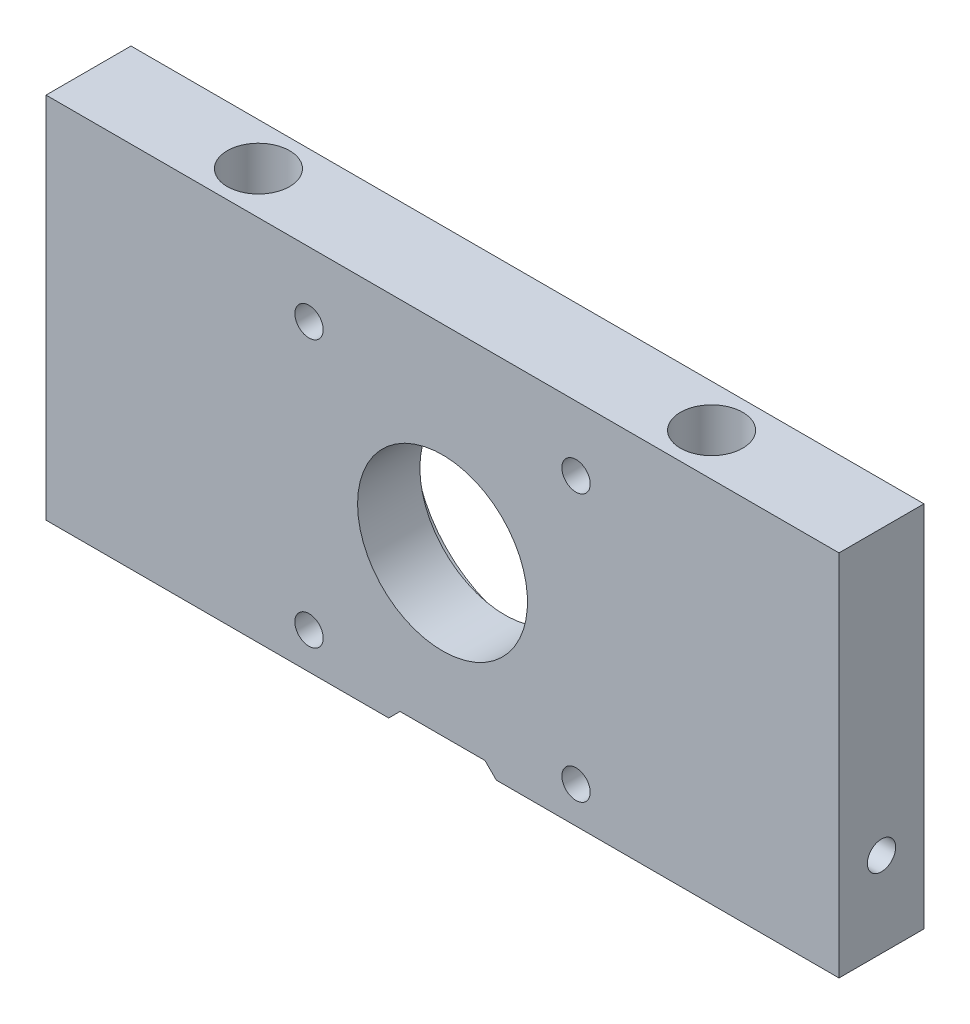
ISO-10303-21;
HEADER;
FILE_DESCRIPTION(('STEP AP214'),'2;1');
FILE_NAME('part.step','',(''),(''),'','','');
FILE_SCHEMA(('AUTOMOTIVE_DESIGN { 1 0 10303 214 1 1 1 1 }'));
ENDSEC;
DATA;
#1=APPLICATION_CONTEXT('core data for automotive mechanical design processes');
#2=APPLICATION_PROTOCOL_DEFINITION('international standard','automotive_design',2000,#1);
#3=PRODUCT_CONTEXT('',#1,'mechanical');
#4=PRODUCT('Part','Part','',(#3));
#5=PRODUCT_RELATED_PRODUCT_CATEGORY('part','',(#4));
#6=PRODUCT_DEFINITION_FORMATION('','',#4);
#7=PRODUCT_DEFINITION_CONTEXT('part definition',#1,'design');
#8=PRODUCT_DEFINITION('design','',#6,#7);
#9=PRODUCT_DEFINITION_SHAPE('','',#8);
#10=(LENGTH_UNIT() NAMED_UNIT(*) SI_UNIT(.MILLI.,.METRE.));
#11=(NAMED_UNIT(*) PLANE_ANGLE_UNIT() SI_UNIT($,.RADIAN.));
#12=(NAMED_UNIT(*) SI_UNIT($,.STERADIAN.) SOLID_ANGLE_UNIT());
#13=UNCERTAINTY_MEASURE_WITH_UNIT(LENGTH_MEASURE(1.E-05),#10,'distance_accuracy_value','');
#14=(GEOMETRIC_REPRESENTATION_CONTEXT(3) GLOBAL_UNCERTAINTY_ASSIGNED_CONTEXT((#13)) GLOBAL_UNIT_ASSIGNED_CONTEXT((#10,
#11,#12)) REPRESENTATION_CONTEXT('',''));
#15=CARTESIAN_POINT('',(0.,0.,0.));
#16=DIRECTION('',(0.,0.,1.));
#17=DIRECTION('',(1.,0.,0.));
#18=AXIS2_PLACEMENT_3D('',#15,#16,#17);
#19=CARTESIAN_POINT('',(0.,-2.49999999999999,-12.));
#20=DIRECTION('',(0.,0.,1.));
#21=DIRECTION('',(1.,0.,0.));
#22=AXIS2_PLACEMENT_3D('',#19,#20,#21);
#23=CYLINDRICAL_SURFACE('',#22,15.);
#24=CARTESIAN_POINT('',(0.,-2.49999999999999,15.));
#25=DIRECTION('',(0.,0.,-1.));
#26=DIRECTION('',(-1.,0.,0.));
#27=AXIS2_PLACEMENT_3D('',#24,#25,#26);
#28=CIRCLE('',#27,15.);
#29=CARTESIAN_POINT('',(-15.,-2.49999999999999,15.));
#30=VERTEX_POINT('',#29);
#31=EDGE_CURVE('E135',#30,#30,#28,.T.);
#32=ORIENTED_EDGE('',*,*,#31,.F.);
#33=EDGE_LOOP('',(#32));
#34=FACE_BOUND('',#33,.T.);
#35=CARTESIAN_POINT('',(0.,-2.49999999999999,4.));
#36=DIRECTION('',(0.,0.,-1.));
#37=DIRECTION('',(-1.,0.,0.));
#38=AXIS2_PLACEMENT_3D('',#35,#36,#37);
#39=CIRCLE('',#38,15.);
#40=CARTESIAN_POINT('',(-15.,-2.49999999999999,4.));
#41=VERTEX_POINT('',#40);
#42=EDGE_CURVE('E39',#41,#41,#39,.T.);
#43=ORIENTED_EDGE('',*,*,#42,.T.);
#44=EDGE_LOOP('',(#43));
#45=FACE_BOUND('',#44,.T.);
#46=ADVANCED_FACE('F35',(#34,#45),#23,.F.);
#47=CARTESIAN_POINT('',(-70.,-32.5,15.));
#48=DIRECTION('',(0.,1.,0.));
#49=DIRECTION('',(0.,0.,1.));
#50=AXIS2_PLACEMENT_3D('',#47,#48,#49);
#51=PLANE('',#50);
#52=CARTESIAN_POINT('',(-40.,-32.5,7.50000000000001));
#53=DIRECTION('',(0.,1.,0.));
#54=DIRECTION('',(0.,0.,1.));
#55=AXIS2_PLACEMENT_3D('',#52,#53,#54);
#56=CIRCLE('',#55,3.29999999999998);
#57=CARTESIAN_POINT('',(-40.,-32.5,10.8));
#58=VERTEX_POINT('',#57);
#59=EDGE_CURVE('E128',#58,#58,#56,.T.);
#60=ORIENTED_EDGE('',*,*,#59,.T.);
#61=EDGE_LOOP('',(#60));
#62=FACE_BOUND('',#61,.T.);
#63=DIRECTION('',(1.,0.,0.));
#64=VECTOR('',#63,1.);
#65=CARTESIAN_POINT('',(-70.,-32.5,0.));
#66=LINE('',#65,#64);
#67=CARTESIAN_POINT('',(-70.,-32.5,0.));
#68=VERTEX_POINT('',#67);
#69=CARTESIAN_POINT('',(-9.49999999999989,-32.5,0.));
#70=VERTEX_POINT('',#69);
#71=EDGE_CURVE('E63',#68,#70,#66,.T.);
#72=ORIENTED_EDGE('',*,*,#71,.T.);
#73=DIRECTION('',(0.,0.,-1.));
#74=VECTOR('',#73,1.);
#75=CARTESIAN_POINT('',(-9.49999999999989,-32.5,15.));
#76=LINE('',#75,#74);
#77=CARTESIAN_POINT('',(-9.49999999999989,-32.5,15.));
#78=VERTEX_POINT('',#77);
#79=EDGE_CURVE('E188',#70,#78,#76,.F.);
#80=ORIENTED_EDGE('',*,*,#79,.T.);
#81=DIRECTION('',(1.,0.,0.));
#82=VECTOR('',#81,1.);
#83=CARTESIAN_POINT('',(-70.,-32.5,15.));
#84=LINE('',#83,#82);
#85=CARTESIAN_POINT('',(-70.,-32.5,15.));
#86=VERTEX_POINT('',#85);
#87=EDGE_CURVE('E71',#86,#78,#84,.T.);
#88=ORIENTED_EDGE('',*,*,#87,.F.);
#89=DIRECTION('',(0.,0.,-1.));
#90=VECTOR('',#89,1.);
#91=CARTESIAN_POINT('',(-70.,-32.5,15.));
#92=LINE('',#91,#90);
#93=EDGE_CURVE('E165',#86,#68,#92,.T.);
#94=ORIENTED_EDGE('',*,*,#93,.T.);
#95=EDGE_LOOP('',(#72,#80,#88,#94));
#96=FACE_BOUND('',#95,.T.);
#97=ADVANCED_FACE('F241',(#62,#96),#51,.F.);
#98=CARTESIAN_POINT('',(70.,32.5,15.));
#99=DIRECTION('',(-1.,0.,0.));
#100=DIRECTION('',(0.,-1.,0.));
#101=AXIS2_PLACEMENT_3D('',#98,#99,#100);
#102=PLANE('',#101);
#103=CARTESIAN_POINT('',(70.,-17.5,7.5));
#104=DIRECTION('',(1.,0.,0.));
#105=DIRECTION('',(0.,0.,-1.));
#106=AXIS2_PLACEMENT_3D('',#103,#104,#105);
#107=CIRCLE('',#106,2.5);
#108=CARTESIAN_POINT('',(70.,-17.5,5.));
#109=VERTEX_POINT('',#108);
#110=EDGE_CURVE('E122',#109,#109,#107,.T.);
#111=ORIENTED_EDGE('',*,*,#110,.F.);
#112=EDGE_LOOP('',(#111));
#113=FACE_BOUND('',#112,.T.);
#114=DIRECTION('',(0.,1.,0.));
#115=VECTOR('',#114,1.);
#116=CARTESIAN_POINT('',(70.,32.5,0.));
#117=LINE('',#116,#115);
#118=CARTESIAN_POINT('',(70.,-32.5,0.));
#119=VERTEX_POINT('',#118);
#120=CARTESIAN_POINT('',(70.,32.5,0.));
#121=VERTEX_POINT('',#120);
#122=EDGE_CURVE('E154',#119,#121,#117,.T.);
#123=ORIENTED_EDGE('',*,*,#122,.T.);
#124=DIRECTION('',(0.,0.,-1.));
#125=VECTOR('',#124,1.);
#126=CARTESIAN_POINT('',(70.,32.5,15.));
#127=LINE('',#126,#125);
#128=CARTESIAN_POINT('',(70.,32.5,15.));
#129=VERTEX_POINT('',#128);
#130=EDGE_CURVE('E170',#129,#121,#127,.T.);
#131=ORIENTED_EDGE('',*,*,#130,.F.);
#132=DIRECTION('',(0.,1.,0.));
#133=VECTOR('',#132,1.);
#134=CARTESIAN_POINT('',(70.,32.5,15.));
#135=LINE('',#134,#133);
#136=CARTESIAN_POINT('',(70.,-32.5,15.));
#137=VERTEX_POINT('',#136);
#138=EDGE_CURVE('E144',#137,#129,#135,.T.);
#139=ORIENTED_EDGE('',*,*,#138,.F.);
#140=DIRECTION('',(0.,0.,-1.));
#141=VECTOR('',#140,1.);
#142=CARTESIAN_POINT('',(70.,-32.5,15.));
#143=LINE('',#142,#141);
#144=EDGE_CURVE('E153',#137,#119,#143,.T.);
#145=ORIENTED_EDGE('',*,*,#144,.T.);
#146=EDGE_LOOP('',(#123,#131,#139,#145));
#147=FACE_BOUND('',#146,.T.);
#148=ADVANCED_FACE('F266',(#113,#147),#102,.F.);
#149=CARTESIAN_POINT('',(-70.,32.5,15.));
#150=DIRECTION('',(0.,-1.,0.));
#151=DIRECTION('',(0.,0.,-1.));
#152=AXIS2_PLACEMENT_3D('',#149,#150,#151);
#153=PLANE('',#152);
#154=CARTESIAN_POINT('',(40.,32.5,7.50000000000001));
#155=DIRECTION('',(0.,1.,0.));
#156=DIRECTION('',(0.,0.,1.));
#157=AXIS2_PLACEMENT_3D('',#154,#155,#156);
#158=CIRCLE('',#157,5.5);
#159=CARTESIAN_POINT('',(40.,32.5,13.));
#160=VERTEX_POINT('',#159);
#161=EDGE_CURVE('E211',#160,#160,#158,.T.);
#162=ORIENTED_EDGE('',*,*,#161,.F.);
#163=EDGE_LOOP('',(#162));
#164=FACE_BOUND('',#163,.T.);
#165=CARTESIAN_POINT('',(-40.,32.5,7.50000000000001));
#166=DIRECTION('',(0.,1.,0.));
#167=DIRECTION('',(0.,0.,1.));
#168=AXIS2_PLACEMENT_3D('',#165,#166,#167);
#169=CIRCLE('',#168,5.5);
#170=CARTESIAN_POINT('',(-40.,32.5,13.));
#171=VERTEX_POINT('',#170);
#172=EDGE_CURVE('E230',#171,#171,#169,.T.);
#173=ORIENTED_EDGE('',*,*,#172,.F.);
#174=EDGE_LOOP('',(#173));
#175=FACE_BOUND('',#174,.T.);
#176=DIRECTION('',(-1.,0.,0.));
#177=VECTOR('',#176,1.);
#178=CARTESIAN_POINT('',(-70.,32.5,0.));
#179=LINE('',#178,#177);
#180=CARTESIAN_POINT('',(-70.,32.5,0.));
#181=VERTEX_POINT('',#180);
#182=EDGE_CURVE('E157',#121,#181,#179,.T.);
#183=ORIENTED_EDGE('',*,*,#182,.T.);
#184=DIRECTION('',(0.,0.,-1.));
#185=VECTOR('',#184,1.);
#186=CARTESIAN_POINT('',(-70.,32.5,15.));
#187=LINE('',#186,#185);
#188=CARTESIAN_POINT('',(-70.,32.5,15.));
#189=VERTEX_POINT('',#188);
#190=EDGE_CURVE('E167',#189,#181,#187,.T.);
#191=ORIENTED_EDGE('',*,*,#190,.F.);
#192=DIRECTION('',(-1.,0.,0.));
#193=VECTOR('',#192,1.);
#194=CARTESIAN_POINT('',(-70.,32.5,15.));
#195=LINE('',#194,#193);
#196=EDGE_CURVE('E147',#129,#189,#195,.T.);
#197=ORIENTED_EDGE('',*,*,#196,.F.);
#198=ORIENTED_EDGE('',*,*,#130,.T.);
#199=EDGE_LOOP('',(#183,#191,#197,#198));
#200=FACE_BOUND('',#199,.T.);
#201=ADVANCED_FACE('F262',(#164,#175,#200),#153,.F.);
#202=CARTESIAN_POINT('',(-70.,32.5,15.));
#203=DIRECTION('',(1.,0.,0.));
#204=DIRECTION('',(0.,1.,0.));
#205=AXIS2_PLACEMENT_3D('',#202,#203,#204);
#206=PLANE('',#205);
#207=DIRECTION('',(0.,-1.,0.));
#208=VECTOR('',#207,1.);
#209=CARTESIAN_POINT('',(-70.,32.5,0.));
#210=LINE('',#209,#208);
#211=EDGE_CURVE('E160',#181,#68,#210,.T.);
#212=ORIENTED_EDGE('',*,*,#211,.T.);
#213=ORIENTED_EDGE('',*,*,#93,.F.);
#214=DIRECTION('',(0.,-1.,0.));
#215=VECTOR('',#214,1.);
#216=CARTESIAN_POINT('',(-70.,32.5,15.));
#217=LINE('',#216,#215);
#218=EDGE_CURVE('E149',#189,#86,#217,.T.);
#219=ORIENTED_EDGE('',*,*,#218,.F.);
#220=ORIENTED_EDGE('',*,*,#190,.T.);
#221=EDGE_LOOP('',(#212,#213,#219,#220));
#222=FACE_BOUND('',#221,.T.);
#223=ADVANCED_FACE('F265',(#222),#206,.F.);
#224=CARTESIAN_POINT('',(40.,-32.5,7.50000000000001));
#225=DIRECTION('',(0.,1.,0.));
#226=DIRECTION('',(0.,0.,1.));
#227=AXIS2_PLACEMENT_3D('',#224,#225,#226);
#228=CIRCLE('',#227,3.29999999999998);
#229=CARTESIAN_POINT('',(40.,-32.5,10.8));
#230=VERTEX_POINT('',#229);
#231=EDGE_CURVE('E227',#230,#230,#228,.T.);
#232=ORIENTED_EDGE('',*,*,#231,.T.);
#233=EDGE_LOOP('',(#232));
#234=FACE_BOUND('',#233,.T.);
#235=CARTESIAN_POINT('',(9.49999999999984,-32.5,15.));
#236=VERTEX_POINT('',#235);
#237=EDGE_CURVE('E151',#236,#137,#84,.T.);
#238=ORIENTED_EDGE('',*,*,#237,.F.);
#239=DIRECTION('',(0.,0.,1.));
#240=VECTOR('',#239,1.);
#241=CARTESIAN_POINT('',(9.49999999999984,-32.5,15.));
#242=LINE('',#241,#240);
#243=CARTESIAN_POINT('',(9.49999999999984,-32.5,0.));
#244=VERTEX_POINT('',#243);
#245=EDGE_CURVE('E45',#236,#244,#242,.F.);
#246=ORIENTED_EDGE('',*,*,#245,.T.);
#247=EDGE_CURVE('E51',#244,#119,#66,.T.);
#248=ORIENTED_EDGE('',*,*,#247,.T.);
#249=ORIENTED_EDGE('',*,*,#144,.F.);
#250=EDGE_LOOP('',(#238,#246,#248,#249));
#251=FACE_BOUND('',#250,.T.);
#252=ADVANCED_FACE('F199',(#234,#251),#51,.F.);
#253=CARTESIAN_POINT('',(0.,0.,15.));
#254=DIRECTION('',(0.,0.,1.));
#255=DIRECTION('',(1.,0.,0.));
#256=AXIS2_PLACEMENT_3D('',#253,#254,#255);
#257=PLANE('',#256);
#258=ORIENTED_EDGE('',*,*,#87,.T.);
#259=DIRECTION('',(-0.707106781186544,-0.707106781186551,0.));
#260=VECTOR('',#259,1.);
#261=CARTESIAN_POINT('',(-17.5000000000001,-40.5000000000002,15.));
#262=LINE('',#261,#260);
#263=CARTESIAN_POINT('',(-7.49999999999992,-30.5,15.));
#264=VERTEX_POINT('',#263);
#265=EDGE_CURVE('E190',#78,#264,#262,.F.);
#266=ORIENTED_EDGE('',*,*,#265,.T.);
#267=DIRECTION('',(-1.,0.,0.));
#268=VECTOR('',#267,1.);
#269=CARTESIAN_POINT('',(-17.5,-30.5,15.));
#270=LINE('',#269,#268);
#271=CARTESIAN_POINT('',(7.49999999999983,-30.5,15.));
#272=VERTEX_POINT('',#271);
#273=EDGE_CURVE('E212',#272,#264,#270,.T.);
#274=ORIENTED_EDGE('',*,*,#273,.F.);
#275=DIRECTION('',(-0.707106781186551,0.707106781186544,0.));
#276=VECTOR('',#275,1.);
#277=CARTESIAN_POINT('',(7.49999999999983,-30.5,15.));
#278=LINE('',#277,#276);
#279=EDGE_CURVE('E193',#272,#236,#278,.F.);
#280=ORIENTED_EDGE('',*,*,#279,.T.);
#281=ORIENTED_EDGE('',*,*,#237,.T.);
#282=ORIENTED_EDGE('',*,*,#138,.T.);
#283=ORIENTED_EDGE('',*,*,#196,.T.);
#284=ORIENTED_EDGE('',*,*,#218,.T.);
#285=EDGE_LOOP('',(#258,#266,#274,#280,#281,#282,#283,#284));
#286=FACE_BOUND('',#285,.T.);
#287=CARTESIAN_POINT('',(23.57,-26.07,15.));
#288=DIRECTION('',(0.,0.,-1.));
#289=DIRECTION('',(-1.,0.,0.));
#290=AXIS2_PLACEMENT_3D('',#287,#288,#289);
#291=CIRCLE('',#290,2.5);
#292=CARTESIAN_POINT('',(21.07,-26.07,15.));
#293=VERTEX_POINT('',#292);
#294=EDGE_CURVE('E121',#293,#293,#291,.T.);
#295=ORIENTED_EDGE('',*,*,#294,.T.);
#296=EDGE_LOOP('',(#295));
#297=FACE_BOUND('',#296,.T.);
#298=CARTESIAN_POINT('',(-23.57,-26.07,15.));
#299=DIRECTION('',(0.,0.,-1.));
#300=DIRECTION('',(-1.,0.,0.));
#301=AXIS2_PLACEMENT_3D('',#298,#299,#300);
#302=CIRCLE('',#301,2.5);
#303=CARTESIAN_POINT('',(-26.07,-26.07,15.));
#304=VERTEX_POINT('',#303);
#305=EDGE_CURVE('E125',#304,#304,#302,.T.);
#306=ORIENTED_EDGE('',*,*,#305,.T.);
#307=EDGE_LOOP('',(#306));
#308=FACE_BOUND('',#307,.T.);
#309=CARTESIAN_POINT('',(-23.57,21.07,15.));
#310=DIRECTION('',(0.,0.,-1.));
#311=DIRECTION('',(-1.,0.,0.));
#312=AXIS2_PLACEMENT_3D('',#309,#310,#311);
#313=CIRCLE('',#312,2.5);
#314=CARTESIAN_POINT('',(-26.07,21.07,15.));
#315=VERTEX_POINT('',#314);
#316=EDGE_CURVE('E136',#315,#315,#313,.T.);
#317=ORIENTED_EDGE('',*,*,#316,.T.);
#318=EDGE_LOOP('',(#317));
#319=FACE_BOUND('',#318,.T.);
#320=CARTESIAN_POINT('',(23.57,21.07,15.));
#321=DIRECTION('',(0.,0.,-1.));
#322=DIRECTION('',(-1.,0.,0.));
#323=AXIS2_PLACEMENT_3D('',#320,#321,#322);
#324=CIRCLE('',#323,2.5);
#325=CARTESIAN_POINT('',(21.07,21.07,15.));
#326=VERTEX_POINT('',#325);
#327=EDGE_CURVE('E132',#326,#326,#324,.T.);
#328=ORIENTED_EDGE('',*,*,#327,.T.);
#329=EDGE_LOOP('',(#328));
#330=FACE_BOUND('',#329,.T.);
#331=ORIENTED_EDGE('',*,*,#31,.T.);
#332=EDGE_LOOP('',(#331));
#333=FACE_BOUND('',#332,.T.);
#334=ADVANCED_FACE('F290',(#286,#297,#308,#319,#330,#333),#257,.T.);
#335=CARTESIAN_POINT('',(0.,0.,0.));
#336=DIRECTION('',(0.,0.,1.));
#337=DIRECTION('',(1.,0.,0.));
#338=AXIS2_PLACEMENT_3D('',#335,#336,#337);
#339=PLANE('',#338);
#340=CARTESIAN_POINT('',(0.,-2.49999999999999,0.));
#341=DIRECTION('',(0.,0.,-1.));
#342=DIRECTION('',(-1.,0.,0.));
#343=AXIS2_PLACEMENT_3D('',#340,#341,#342);
#344=CIRCLE('',#343,20.);
#345=CARTESIAN_POINT('',(-20.,-2.49999999999999,0.));
#346=VERTEX_POINT('',#345);
#347=EDGE_CURVE('E219',#346,#346,#344,.T.);
#348=ORIENTED_EDGE('',*,*,#347,.F.);
#349=EDGE_LOOP('',(#348));
#350=FACE_BOUND('',#349,.T.);
#351=CARTESIAN_POINT('',(23.57,-26.07,0.));
#352=DIRECTION('',(0.,0.,1.));
#353=DIRECTION('',(1.,0.,0.));
#354=AXIS2_PLACEMENT_3D('',#351,#352,#353);
#355=CIRCLE('',#354,2.5);
#356=CARTESIAN_POINT('',(26.07,-26.07,0.));
#357=VERTEX_POINT('',#356);
#358=EDGE_CURVE('E158',#357,#357,#355,.F.);
#359=ORIENTED_EDGE('',*,*,#358,.F.);
#360=EDGE_LOOP('',(#359));
#361=FACE_BOUND('',#360,.T.);
#362=CARTESIAN_POINT('',(-23.57,-26.07,0.));
#363=DIRECTION('',(0.,0.,1.));
#364=DIRECTION('',(1.,0.,0.));
#365=AXIS2_PLACEMENT_3D('',#362,#363,#364);
#366=CIRCLE('',#365,2.5);
#367=CARTESIAN_POINT('',(-21.07,-26.07,0.));
#368=VERTEX_POINT('',#367);
#369=EDGE_CURVE('E179',#368,#368,#366,.F.);
#370=ORIENTED_EDGE('',*,*,#369,.F.);
#371=EDGE_LOOP('',(#370));
#372=FACE_BOUND('',#371,.T.);
#373=CARTESIAN_POINT('',(-23.57,21.07,0.));
#374=DIRECTION('',(0.,0.,1.));
#375=DIRECTION('',(1.,0.,0.));
#376=AXIS2_PLACEMENT_3D('',#373,#374,#375);
#377=CIRCLE('',#376,2.5);
#378=CARTESIAN_POINT('',(-21.07,21.07,0.));
#379=VERTEX_POINT('',#378);
#380=EDGE_CURVE('E176',#379,#379,#377,.F.);
#381=ORIENTED_EDGE('',*,*,#380,.F.);
#382=EDGE_LOOP('',(#381));
#383=FACE_BOUND('',#382,.T.);
#384=CARTESIAN_POINT('',(23.57,21.07,0.));
#385=DIRECTION('',(0.,0.,1.));
#386=DIRECTION('',(1.,0.,0.));
#387=AXIS2_PLACEMENT_3D('',#384,#385,#386);
#388=CIRCLE('',#387,2.5);
#389=CARTESIAN_POINT('',(26.07,21.07,0.));
#390=VERTEX_POINT('',#389);
#391=EDGE_CURVE('E143',#390,#390,#388,.F.);
#392=ORIENTED_EDGE('',*,*,#391,.F.);
#393=EDGE_LOOP('',(#392));
#394=FACE_BOUND('',#393,.T.);
#395=ORIENTED_EDGE('',*,*,#247,.F.);
#396=DIRECTION('',(0.707106781186551,-0.707106781186544,0.));
#397=VECTOR('',#396,1.);
#398=CARTESIAN_POINT('',(-11.5000000000001,-11.5000000000002,0.));
#399=LINE('',#398,#397);
#400=CARTESIAN_POINT('',(7.49999999999983,-30.5,0.));
#401=VERTEX_POINT('',#400);
#402=EDGE_CURVE('E11',#244,#401,#399,.F.);
#403=ORIENTED_EDGE('',*,*,#402,.T.);
#404=DIRECTION('',(-1.,0.,0.));
#405=VECTOR('',#404,1.);
#406=CARTESIAN_POINT('',(-17.5,-30.5,0.));
#407=LINE('',#406,#405);
#408=CARTESIAN_POINT('',(-7.49999999999992,-30.5,0.));
#409=VERTEX_POINT('',#408);
#410=EDGE_CURVE('E206',#401,#409,#407,.T.);
#411=ORIENTED_EDGE('',*,*,#410,.T.);
#412=DIRECTION('',(0.707106781186544,0.707106781186551,0.));
#413=VECTOR('',#412,1.);
#414=CARTESIAN_POINT('',(11.5,-11.4999999999999,0.));
#415=LINE('',#414,#413);
#416=EDGE_CURVE('E77',#409,#70,#415,.F.);
#417=ORIENTED_EDGE('',*,*,#416,.T.);
#418=ORIENTED_EDGE('',*,*,#71,.F.);
#419=ORIENTED_EDGE('',*,*,#211,.F.);
#420=ORIENTED_EDGE('',*,*,#182,.F.);
#421=ORIENTED_EDGE('',*,*,#122,.F.);
#422=EDGE_LOOP('',(#395,#403,#411,#417,#418,#419,#420,#421));
#423=FACE_BOUND('',#422,.T.);
#424=ADVANCED_FACE('F205',(#350,#361,#372,#383,#394,#423),#339,.F.);
#425=CARTESIAN_POINT('',(23.57,21.07,-12.));
#426=DIRECTION('',(0.,0.,1.));
#427=DIRECTION('',(1.,0.,0.));
#428=AXIS2_PLACEMENT_3D('',#425,#426,#427);
#429=CYLINDRICAL_SURFACE('',#428,2.5);
#430=ORIENTED_EDGE('',*,*,#327,.F.);
#431=EDGE_LOOP('',(#430));
#432=FACE_BOUND('',#431,.T.);
#433=ORIENTED_EDGE('',*,*,#391,.T.);
#434=EDGE_LOOP('',(#433));
#435=FACE_BOUND('',#434,.T.);
#436=ADVANCED_FACE('F323',(#432,#435),#429,.F.);
#437=CARTESIAN_POINT('',(-23.57,21.07,-12.));
#438=DIRECTION('',(0.,0.,1.));
#439=DIRECTION('',(1.,0.,0.));
#440=AXIS2_PLACEMENT_3D('',#437,#438,#439);
#441=CYLINDRICAL_SURFACE('',#440,2.5);
#442=ORIENTED_EDGE('',*,*,#316,.F.);
#443=EDGE_LOOP('',(#442));
#444=FACE_BOUND('',#443,.T.);
#445=ORIENTED_EDGE('',*,*,#380,.T.);
#446=EDGE_LOOP('',(#445));
#447=FACE_BOUND('',#446,.T.);
#448=ADVANCED_FACE('F326',(#444,#447),#441,.F.);
#449=CARTESIAN_POINT('',(-23.57,-26.07,-12.));
#450=DIRECTION('',(0.,0.,1.));
#451=DIRECTION('',(1.,0.,0.));
#452=AXIS2_PLACEMENT_3D('',#449,#450,#451);
#453=CYLINDRICAL_SURFACE('',#452,2.5);
#454=ORIENTED_EDGE('',*,*,#305,.F.);
#455=EDGE_LOOP('',(#454));
#456=FACE_BOUND('',#455,.T.);
#457=ORIENTED_EDGE('',*,*,#369,.T.);
#458=EDGE_LOOP('',(#457));
#459=FACE_BOUND('',#458,.T.);
#460=ADVANCED_FACE('F330',(#456,#459),#453,.F.);
#461=CARTESIAN_POINT('',(23.57,-26.07,-12.));
#462=DIRECTION('',(0.,0.,1.));
#463=DIRECTION('',(1.,0.,0.));
#464=AXIS2_PLACEMENT_3D('',#461,#462,#463);
#465=CYLINDRICAL_SURFACE('',#464,2.5);
#466=ORIENTED_EDGE('',*,*,#294,.F.);
#467=EDGE_LOOP('',(#466));
#468=FACE_BOUND('',#467,.T.);
#469=ORIENTED_EDGE('',*,*,#358,.T.);
#470=EDGE_LOOP('',(#469));
#471=FACE_BOUND('',#470,.T.);
#472=ADVANCED_FACE('F115',(#468,#471),#465,.F.);
#473=CARTESIAN_POINT('',(55.,-17.5,7.5));
#474=DIRECTION('',(1.,0.,0.));
#475=DIRECTION('',(0.,0.,-1.));
#476=AXIS2_PLACEMENT_3D('',#473,#474,#475);
#477=CONICAL_SURFACE('',#476,2.5,1.02974425867665);
#478=CARTESIAN_POINT('',(53.4978484524311,-17.5,7.5));
#479=VERTEX_POINT('',#478);
#480=VERTEX_LOOP('',#479);
#481=FACE_BOUND('',#480,.T.);
#482=CARTESIAN_POINT('',(55.,-17.5,7.5));
#483=DIRECTION('',(1.,0.,0.));
#484=DIRECTION('',(0.,0.,-1.));
#485=AXIS2_PLACEMENT_3D('',#482,#483,#484);
#486=CIRCLE('',#485,2.5);
#487=CARTESIAN_POINT('',(55.,-17.5,5.));
#488=VERTEX_POINT('',#487);
#489=EDGE_CURVE('E119',#488,#488,#486,.T.);
#490=ORIENTED_EDGE('',*,*,#489,.T.);
#491=EDGE_LOOP('',(#490));
#492=FACE_BOUND('',#491,.T.);
#493=ADVANCED_FACE('F111',(#481,#492),#477,.F.);
#494=CARTESIAN_POINT('',(70.,-17.5,7.5));
#495=DIRECTION('',(1.,0.,0.));
#496=DIRECTION('',(0.,0.,-1.));
#497=AXIS2_PLACEMENT_3D('',#494,#495,#496);
#498=CYLINDRICAL_SURFACE('',#497,2.5);
#499=ORIENTED_EDGE('',*,*,#489,.F.);
#500=EDGE_LOOP('',(#499));
#501=FACE_BOUND('',#500,.T.);
#502=ORIENTED_EDGE('',*,*,#110,.T.);
#503=EDGE_LOOP('',(#502));
#504=FACE_BOUND('',#503,.T.);
#505=ADVANCED_FACE('F114',(#501,#504),#498,.F.);
#506=CARTESIAN_POINT('',(-40.,32.5,7.50000000000001));
#507=DIRECTION('',(0.,1.,0.));
#508=DIRECTION('',(0.,0.,1.));
#509=AXIS2_PLACEMENT_3D('',#506,#507,#508);
#510=CYLINDRICAL_SURFACE('',#509,3.29999999999998);
#511=ORIENTED_EDGE('',*,*,#59,.F.);
#512=EDGE_LOOP('',(#511));
#513=FACE_BOUND('',#512,.T.);
#514=CARTESIAN_POINT('',(-40.,-28.9,7.50000000000001));
#515=DIRECTION('',(0.,1.,0.));
#516=DIRECTION('',(0.,0.,1.));
#517=AXIS2_PLACEMENT_3D('',#514,#515,#516);
#518=CIRCLE('',#517,3.29999999999998);
#519=CARTESIAN_POINT('',(-40.,-28.9,10.8));
#520=VERTEX_POINT('',#519);
#521=EDGE_CURVE('E236',#520,#520,#518,.T.);
#522=ORIENTED_EDGE('',*,*,#521,.T.);
#523=EDGE_LOOP('',(#522));
#524=FACE_BOUND('',#523,.T.);
#525=ADVANCED_FACE('F243',(#513,#524),#510,.F.);
#526=CARTESIAN_POINT('',(-36.7,-28.9,7.50000000000001));
#527=DIRECTION('',(0.,-1.,0.));
#528=DIRECTION('',(0.,0.,-1.));
#529=AXIS2_PLACEMENT_3D('',#526,#527,#528);
#530=PLANE('',#529);
#531=ORIENTED_EDGE('',*,*,#521,.F.);
#532=EDGE_LOOP('',(#531));
#533=FACE_BOUND('',#532,.T.);
#534=CARTESIAN_POINT('',(-40.,-28.9,7.50000000000001));
#535=DIRECTION('',(0.,1.,0.));
#536=DIRECTION('',(0.,0.,1.));
#537=AXIS2_PLACEMENT_3D('',#534,#535,#536);
#538=CIRCLE('',#537,5.49999999999998);
#539=CARTESIAN_POINT('',(-40.,-28.9,13.));
#540=VERTEX_POINT('',#539);
#541=EDGE_CURVE('E233',#540,#540,#538,.T.);
#542=ORIENTED_EDGE('',*,*,#541,.T.);
#543=EDGE_LOOP('',(#542));
#544=FACE_BOUND('',#543,.T.);
#545=ADVANCED_FACE('F246',(#533,#544),#530,.F.);
#546=CARTESIAN_POINT('',(-40.,32.5,7.50000000000001));
#547=DIRECTION('',(0.,1.,0.));
#548=DIRECTION('',(0.,0.,1.));
#549=AXIS2_PLACEMENT_3D('',#546,#547,#548);
#550=CYLINDRICAL_SURFACE('',#549,5.49999999999999);
#551=ORIENTED_EDGE('',*,*,#541,.F.);
#552=EDGE_LOOP('',(#551));
#553=FACE_BOUND('',#552,.T.);
#554=ORIENTED_EDGE('',*,*,#172,.T.);
#555=EDGE_LOOP('',(#554));
#556=FACE_BOUND('',#555,.T.);
#557=ADVANCED_FACE('F252',(#553,#556),#550,.F.);
#558=CARTESIAN_POINT('',(40.,32.5,7.50000000000001));
#559=DIRECTION('',(0.,1.,0.));
#560=DIRECTION('',(0.,0.,1.));
#561=AXIS2_PLACEMENT_3D('',#558,#559,#560);
#562=CYLINDRICAL_SURFACE('',#561,3.29999999999998);
#563=ORIENTED_EDGE('',*,*,#231,.F.);
#564=EDGE_LOOP('',(#563));
#565=FACE_BOUND('',#564,.T.);
#566=CARTESIAN_POINT('',(40.,-28.9,7.50000000000001));
#567=DIRECTION('',(0.,1.,0.));
#568=DIRECTION('',(0.,0.,1.));
#569=AXIS2_PLACEMENT_3D('',#566,#567,#568);
#570=CIRCLE('',#569,3.29999999999998);
#571=CARTESIAN_POINT('',(40.,-28.9,10.8));
#572=VERTEX_POINT('',#571);
#573=EDGE_CURVE('E224',#572,#572,#570,.T.);
#574=ORIENTED_EDGE('',*,*,#573,.T.);
#575=EDGE_LOOP('',(#574));
#576=FACE_BOUND('',#575,.T.);
#577=ADVANCED_FACE('F258',(#565,#576),#562,.F.);
#578=CARTESIAN_POINT('',(43.3,-28.9,7.50000000000001));
#579=DIRECTION('',(0.,-1.,0.));
#580=DIRECTION('',(0.,0.,-1.));
#581=AXIS2_PLACEMENT_3D('',#578,#579,#580);
#582=PLANE('',#581);
#583=ORIENTED_EDGE('',*,*,#573,.F.);
#584=EDGE_LOOP('',(#583));
#585=FACE_BOUND('',#584,.T.);
#586=CARTESIAN_POINT('',(40.,-28.9,7.50000000000001));
#587=DIRECTION('',(0.,1.,0.));
#588=DIRECTION('',(0.,0.,1.));
#589=AXIS2_PLACEMENT_3D('',#586,#587,#588);
#590=CIRCLE('',#589,5.49999999999998);
#591=CARTESIAN_POINT('',(40.,-28.9,13.));
#592=VERTEX_POINT('',#591);
#593=EDGE_CURVE('E215',#592,#592,#590,.T.);
#594=ORIENTED_EDGE('',*,*,#593,.T.);
#595=EDGE_LOOP('',(#594));
#596=FACE_BOUND('',#595,.T.);
#597=ADVANCED_FACE('F301',(#585,#596),#582,.F.);
#598=CARTESIAN_POINT('',(40.,32.5,7.50000000000001));
#599=DIRECTION('',(0.,1.,0.));
#600=DIRECTION('',(0.,0.,1.));
#601=AXIS2_PLACEMENT_3D('',#598,#599,#600);
#602=CYLINDRICAL_SURFACE('',#601,5.49999999999999);
#603=ORIENTED_EDGE('',*,*,#593,.F.);
#604=EDGE_LOOP('',(#603));
#605=FACE_BOUND('',#604,.T.);
#606=ORIENTED_EDGE('',*,*,#161,.T.);
#607=EDGE_LOOP('',(#606));
#608=FACE_BOUND('',#607,.T.);
#609=ADVANCED_FACE('F307',(#605,#608),#602,.F.);
#610=CARTESIAN_POINT('',(-17.5,-30.5,0.));
#611=DIRECTION('',(0.,1.,0.));
#612=DIRECTION('',(0.,0.,1.));
#613=AXIS2_PLACEMENT_3D('',#610,#611,#612);
#614=PLANE('',#613);
#615=ORIENTED_EDGE('',*,*,#273,.T.);
#616=DIRECTION('',(0.,0.,-1.));
#617=VECTOR('',#616,1.);
#618=CARTESIAN_POINT('',(-7.49999999999992,-30.5,0.));
#619=LINE('',#618,#617);
#620=EDGE_CURVE('E186',#264,#409,#619,.T.);
#621=ORIENTED_EDGE('',*,*,#620,.T.);
#622=ORIENTED_EDGE('',*,*,#410,.F.);
#623=DIRECTION('',(0.,0.,1.));
#624=VECTOR('',#623,1.);
#625=CARTESIAN_POINT('',(7.49999999999983,-30.5,15.));
#626=LINE('',#625,#624);
#627=EDGE_CURVE('E173',#401,#272,#626,.T.);
#628=ORIENTED_EDGE('',*,*,#627,.T.);
#629=EDGE_LOOP('',(#615,#621,#622,#628));
#630=FACE_BOUND('',#629,.T.);
#631=ADVANCED_FACE('F209',(#630),#614,.F.);
#632=CARTESIAN_POINT('',(-17.5000000000001,-40.5000000000002,0.));
#633=DIRECTION('',(0.707106781186551,-0.707106781186544,0.));
#634=DIRECTION('',(0.,0.,-1.));
#635=AXIS2_PLACEMENT_3D('',#632,#633,#634);
#636=PLANE('',#635);
#637=ORIENTED_EDGE('',*,*,#416,.F.);
#638=ORIENTED_EDGE('',*,*,#620,.F.);
#639=ORIENTED_EDGE('',*,*,#265,.F.);
#640=ORIENTED_EDGE('',*,*,#79,.F.);
#641=EDGE_LOOP('',(#637,#638,#639,#640));
#642=FACE_BOUND('',#641,.T.);
#643=ADVANCED_FACE('F276',(#642),#636,.T.);
#644=CARTESIAN_POINT('',(7.49999999999983,-30.5,0.));
#645=DIRECTION('',(-0.707106781186544,-0.707106781186551,0.));
#646=DIRECTION('',(0.,0.,-1.));
#647=AXIS2_PLACEMENT_3D('',#644,#645,#646);
#648=PLANE('',#647);
#649=ORIENTED_EDGE('',*,*,#402,.F.);
#650=ORIENTED_EDGE('',*,*,#245,.F.);
#651=ORIENTED_EDGE('',*,*,#279,.F.);
#652=ORIENTED_EDGE('',*,*,#627,.F.);
#653=EDGE_LOOP('',(#649,#650,#651,#652));
#654=FACE_BOUND('',#653,.T.);
#655=ADVANCED_FACE('F37',(#654),#648,.T.);
#656=CARTESIAN_POINT('',(0.,-2.49999999999999,4.));
#657=DIRECTION('',(0.,0.,-1.));
#658=DIRECTION('',(-1.,0.,0.));
#659=AXIS2_PLACEMENT_3D('',#656,#657,#658);
#660=CYLINDRICAL_SURFACE('',#659,20.);
#661=CARTESIAN_POINT('',(0.,-2.49999999999999,4.));
#662=DIRECTION('',(0.,0.,-1.));
#663=DIRECTION('',(-1.,0.,0.));
#664=AXIS2_PLACEMENT_3D('',#661,#662,#663);
#665=CIRCLE('',#664,20.);
#666=CARTESIAN_POINT('',(-20.,-2.49999999999999,4.));
#667=VERTEX_POINT('',#666);
#668=EDGE_CURVE('E356',#667,#667,#665,.T.);
#669=ORIENTED_EDGE('',*,*,#668,.F.);
#670=EDGE_LOOP('',(#669));
#671=FACE_BOUND('',#670,.T.);
#672=ORIENTED_EDGE('',*,*,#347,.T.);
#673=EDGE_LOOP('',(#672));
#674=FACE_BOUND('',#673,.T.);
#675=ADVANCED_FACE('F366',(#671,#674),#660,.F.);
#676=CARTESIAN_POINT('',(0.,-2.49999999999999,4.));
#677=DIRECTION('',(0.,0.,-1.));
#678=DIRECTION('',(-1.,0.,0.));
#679=AXIS2_PLACEMENT_3D('',#676,#677,#678);
#680=PLANE('',#679);
#681=ORIENTED_EDGE('',*,*,#42,.F.);
#682=EDGE_LOOP('',(#681));
#683=FACE_BOUND('',#682,.T.);
#684=ORIENTED_EDGE('',*,*,#668,.T.);
#685=EDGE_LOOP('',(#684));
#686=FACE_BOUND('',#685,.T.);
#687=ADVANCED_FACE('F364',(#683,#686),#680,.T.);
#688=CLOSED_SHELL('',(#46,#97,#148,#201,#223,#252,#334,#424,#436,#448,#460,#472,#493,#505,#525,
#545,#557,#577,#597,#609,#631,#643,#655,#675,#687));
#689=MANIFOLD_SOLID_BREP('B2',#688);
#690=ADVANCED_BREP_SHAPE_REPRESENTATION('',(#18,#689),#14);
#691=SHAPE_DEFINITION_REPRESENTATION(#9,#690);
ENDSEC;
END-ISO-10303-21;
